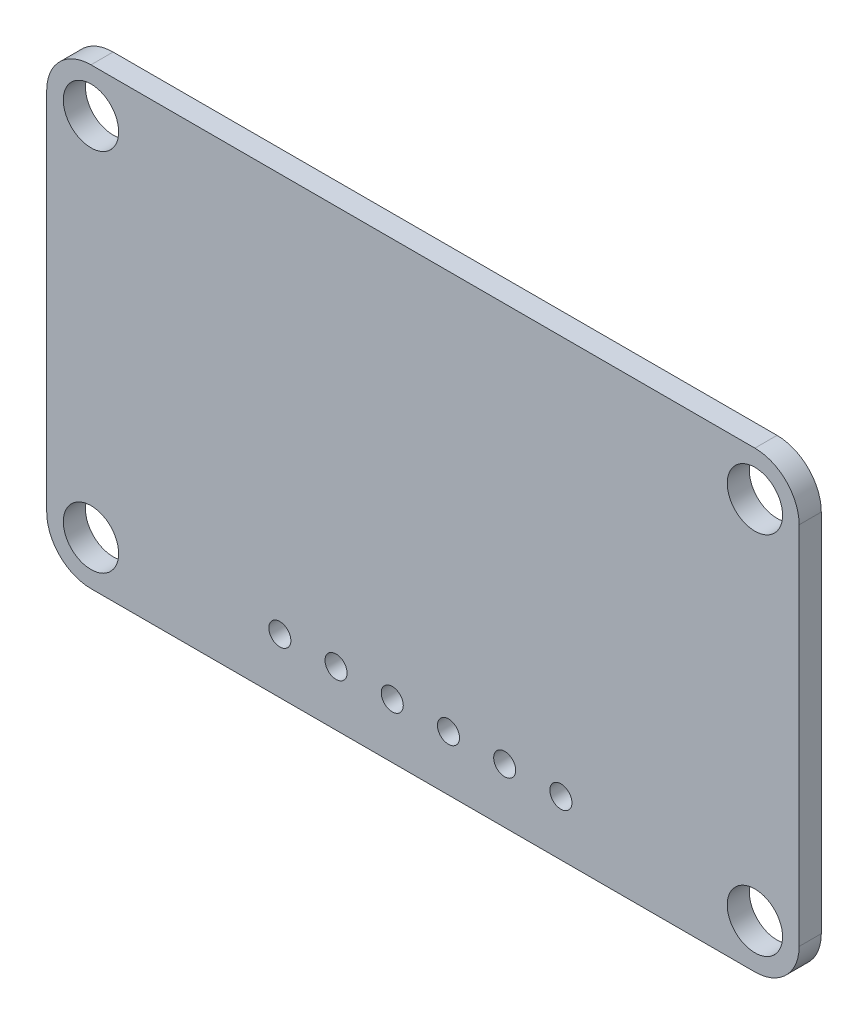
ISO-10303-21;
HEADER;
FILE_DESCRIPTION(('STEP AP214'),'2;1');
FILE_NAME('part.step','',(''),(''),'','','');
FILE_SCHEMA(('AUTOMOTIVE_DESIGN { 1 0 10303 214 1 1 1 1 }'));
ENDSEC;
DATA;
#1=APPLICATION_CONTEXT('core data for automotive mechanical design processes');
#2=APPLICATION_PROTOCOL_DEFINITION('international standard','automotive_design',2000,#1);
#3=PRODUCT_CONTEXT('',#1,'mechanical');
#4=PRODUCT('Part','Part','',(#3));
#5=PRODUCT_RELATED_PRODUCT_CATEGORY('part','',(#4));
#6=PRODUCT_DEFINITION_FORMATION('','',#4);
#7=PRODUCT_DEFINITION_CONTEXT('part definition',#1,'design');
#8=PRODUCT_DEFINITION('design','',#6,#7);
#9=PRODUCT_DEFINITION_SHAPE('','',#8);
#10=(LENGTH_UNIT() NAMED_UNIT(*) SI_UNIT(.MILLI.,.METRE.));
#11=(NAMED_UNIT(*) PLANE_ANGLE_UNIT() SI_UNIT($,.RADIAN.));
#12=(NAMED_UNIT(*) SI_UNIT($,.STERADIAN.) SOLID_ANGLE_UNIT());
#13=UNCERTAINTY_MEASURE_WITH_UNIT(LENGTH_MEASURE(1.E-05),#10,'distance_accuracy_value','');
#14=(GEOMETRIC_REPRESENTATION_CONTEXT(3) GLOBAL_UNCERTAINTY_ASSIGNED_CONTEXT((#13)) GLOBAL_UNIT_ASSIGNED_CONTEXT((#10,
#11,#12)) REPRESENTATION_CONTEXT('',''));
#15=CARTESIAN_POINT('',(0.,0.,0.));
#16=DIRECTION('',(0.,0.,1.));
#17=DIRECTION('',(1.,0.,0.));
#18=AXIS2_PLACEMENT_3D('',#15,#16,#17);
#19=CARTESIAN_POINT('',(-15.24,-10.16,1.));
#20=DIRECTION('',(1.,0.,0.));
#21=DIRECTION('',(0.,0.,-1.));
#22=AXIS2_PLACEMENT_3D('',#19,#20,#21);
#23=PLANE('',#22);
#24=DIRECTION('',(0.,-1.,0.));
#25=VECTOR('',#24,1.);
#26=CARTESIAN_POINT('',(-15.24,-10.16,1.));
#27=LINE('',#26,#25);
#28=CARTESIAN_POINT('',(-15.24,8.34,1.));
#29=VERTEX_POINT('',#28);
#30=CARTESIAN_POINT('',(-15.24,-8.16,1.));
#31=VERTEX_POINT('',#30);
#32=EDGE_CURVE('E131',#29,#31,#27,.T.);
#33=ORIENTED_EDGE('',*,*,#32,.F.);
#34=DIRECTION('',(0.,0.,-1.));
#35=VECTOR('',#34,1.);
#36=CARTESIAN_POINT('',(-15.24,8.34,1.));
#37=LINE('',#36,#35);
#38=CARTESIAN_POINT('',(-15.24,8.34,0.));
#39=VERTEX_POINT('',#38);
#40=EDGE_CURVE('E11',#29,#39,#37,.T.);
#41=ORIENTED_EDGE('',*,*,#40,.T.);
#42=DIRECTION('',(0.,-1.,0.));
#43=VECTOR('',#42,1.);
#44=CARTESIAN_POINT('',(-15.24,-10.16,0.));
#45=LINE('',#44,#43);
#46=CARTESIAN_POINT('',(-15.24,-8.16,0.));
#47=VERTEX_POINT('',#46);
#48=EDGE_CURVE('E162',#39,#47,#45,.T.);
#49=ORIENTED_EDGE('',*,*,#48,.T.);
#50=DIRECTION('',(0.,0.,-1.));
#51=VECTOR('',#50,1.);
#52=CARTESIAN_POINT('',(-15.24,-8.16,1.));
#53=LINE('',#52,#51);
#54=EDGE_CURVE('E45',#47,#31,#53,.F.);
#55=ORIENTED_EDGE('',*,*,#54,.T.);
#56=EDGE_LOOP('',(#33,#41,#49,#55));
#57=FACE_BOUND('',#56,.T.);
#58=ADVANCED_FACE('F37',(#57),#23,.F.);
#59=CARTESIAN_POINT('',(18.76,-10.16,1.));
#60=DIRECTION('',(0.,1.,0.));
#61=DIRECTION('',(0.,0.,1.));
#62=AXIS2_PLACEMENT_3D('',#59,#60,#61);
#63=PLANE('',#62);
#64=DIRECTION('',(1.,0.,0.));
#65=VECTOR('',#64,1.);
#66=CARTESIAN_POINT('',(18.76,-10.16,0.));
#67=LINE('',#66,#65);
#68=CARTESIAN_POINT('',(-13.24,-10.16,0.));
#69=VERTEX_POINT('',#68);
#70=CARTESIAN_POINT('',(16.76,-10.16,0.));
#71=VERTEX_POINT('',#70);
#72=EDGE_CURVE('E136',#69,#71,#67,.T.);
#73=ORIENTED_EDGE('',*,*,#72,.T.);
#74=DIRECTION('',(0.,0.,-1.));
#75=VECTOR('',#74,1.);
#76=CARTESIAN_POINT('',(16.76,-10.16,1.));
#77=LINE('',#76,#75);
#78=CARTESIAN_POINT('',(16.76,-10.16,1.));
#79=VERTEX_POINT('',#78);
#80=EDGE_CURVE('E52',#71,#79,#77,.F.);
#81=ORIENTED_EDGE('',*,*,#80,.T.);
#82=DIRECTION('',(1.,0.,0.));
#83=VECTOR('',#82,1.);
#84=CARTESIAN_POINT('',(18.76,-10.16,1.));
#85=LINE('',#84,#83);
#86=CARTESIAN_POINT('',(-13.24,-10.16,1.));
#87=VERTEX_POINT('',#86);
#88=EDGE_CURVE('E134',#87,#79,#85,.T.);
#89=ORIENTED_EDGE('',*,*,#88,.F.);
#90=DIRECTION('',(0.,0.,-1.));
#91=VECTOR('',#90,1.);
#92=CARTESIAN_POINT('',(-13.24,-10.16,1.));
#93=LINE('',#92,#91);
#94=EDGE_CURVE('E154',#87,#69,#93,.T.);
#95=ORIENTED_EDGE('',*,*,#94,.T.);
#96=EDGE_LOOP('',(#73,#81,#89,#95));
#97=FACE_BOUND('',#96,.T.);
#98=ADVANCED_FACE('F169',(#97),#63,.F.);
#99=CARTESIAN_POINT('',(18.76,10.34,1.));
#100=DIRECTION('',(-1.,0.,0.));
#101=DIRECTION('',(0.,0.,1.));
#102=AXIS2_PLACEMENT_3D('',#99,#100,#101);
#103=PLANE('',#102);
#104=DIRECTION('',(0.,1.,0.));
#105=VECTOR('',#104,1.);
#106=CARTESIAN_POINT('',(18.76,10.34,0.));
#107=LINE('',#106,#105);
#108=CARTESIAN_POINT('',(18.76,-8.16,0.));
#109=VERTEX_POINT('',#108);
#110=CARTESIAN_POINT('',(18.76,8.34,0.));
#111=VERTEX_POINT('',#110);
#112=EDGE_CURVE('E132',#109,#111,#107,.T.);
#113=ORIENTED_EDGE('',*,*,#112,.T.);
#114=DIRECTION('',(0.,0.,-1.));
#115=VECTOR('',#114,1.);
#116=CARTESIAN_POINT('',(18.76,8.34,1.));
#117=LINE('',#116,#115);
#118=CARTESIAN_POINT('',(18.76,8.34,1.));
#119=VERTEX_POINT('',#118);
#120=EDGE_CURVE('E109',#111,#119,#117,.F.);
#121=ORIENTED_EDGE('',*,*,#120,.T.);
#122=DIRECTION('',(0.,1.,0.));
#123=VECTOR('',#122,1.);
#124=CARTESIAN_POINT('',(18.76,10.34,1.));
#125=LINE('',#124,#123);
#126=CARTESIAN_POINT('',(18.76,-8.16,1.));
#127=VERTEX_POINT('',#126);
#128=EDGE_CURVE('E174',#127,#119,#125,.T.);
#129=ORIENTED_EDGE('',*,*,#128,.F.);
#130=DIRECTION('',(0.,0.,-1.));
#131=VECTOR('',#130,1.);
#132=CARTESIAN_POINT('',(18.76,-8.16,1.));
#133=LINE('',#132,#131);
#134=EDGE_CURVE('E114',#127,#109,#133,.T.);
#135=ORIENTED_EDGE('',*,*,#134,.T.);
#136=EDGE_LOOP('',(#113,#121,#129,#135));
#137=FACE_BOUND('',#136,.T.);
#138=ADVANCED_FACE('F287',(#137),#103,.F.);
#139=CARTESIAN_POINT('',(-15.24,10.34,1.));
#140=DIRECTION('',(0.,-1.,0.));
#141=DIRECTION('',(0.,0.,-1.));
#142=AXIS2_PLACEMENT_3D('',#139,#140,#141);
#143=PLANE('',#142);
#144=DIRECTION('',(-1.,0.,0.));
#145=VECTOR('',#144,1.);
#146=CARTESIAN_POINT('',(-15.24,10.34,1.));
#147=LINE('',#146,#145);
#148=CARTESIAN_POINT('',(16.76,10.34,1.));
#149=VERTEX_POINT('',#148);
#150=CARTESIAN_POINT('',(-13.24,10.34,1.));
#151=VERTEX_POINT('',#150);
#152=EDGE_CURVE('E124',#149,#151,#147,.T.);
#153=ORIENTED_EDGE('',*,*,#152,.F.);
#154=DIRECTION('',(0.,0.,-1.));
#155=VECTOR('',#154,1.);
#156=CARTESIAN_POINT('',(16.76,10.34,1.));
#157=LINE('',#156,#155);
#158=CARTESIAN_POINT('',(16.76,10.34,0.));
#159=VERTEX_POINT('',#158);
#160=EDGE_CURVE('E108',#149,#159,#157,.T.);
#161=ORIENTED_EDGE('',*,*,#160,.T.);
#162=DIRECTION('',(-1.,0.,0.));
#163=VECTOR('',#162,1.);
#164=CARTESIAN_POINT('',(-15.24,10.34,0.));
#165=LINE('',#164,#163);
#166=CARTESIAN_POINT('',(-13.24,10.34,0.));
#167=VERTEX_POINT('',#166);
#168=EDGE_CURVE('E121',#159,#167,#165,.T.);
#169=ORIENTED_EDGE('',*,*,#168,.T.);
#170=DIRECTION('',(0.,0.,-1.));
#171=VECTOR('',#170,1.);
#172=CARTESIAN_POINT('',(-13.24,10.34,1.));
#173=LINE('',#172,#171);
#174=EDGE_CURVE('E126',#167,#151,#173,.F.);
#175=ORIENTED_EDGE('',*,*,#174,.T.);
#176=EDGE_LOOP('',(#153,#161,#169,#175));
#177=FACE_BOUND('',#176,.T.);
#178=ADVANCED_FACE('F120',(#177),#143,.F.);
#179=CARTESIAN_POINT('',(0.,0.,1.));
#180=DIRECTION('',(0.,0.,-1.));
#181=DIRECTION('',(-1.,0.,0.));
#182=AXIS2_PLACEMENT_3D('',#179,#180,#181);
#183=PLANE('',#182);
#184=CARTESIAN_POINT('',(-13.24,-8.16,1.));
#185=DIRECTION('',(0.,0.,1.));
#186=DIRECTION('',(1.,0.,0.));
#187=AXIS2_PLACEMENT_3D('',#184,#185,#186);
#188=CIRCLE('',#187,1.25);
#189=CARTESIAN_POINT('',(-11.99,-8.16,1.));
#190=VERTEX_POINT('',#189);
#191=EDGE_CURVE('E219',#190,#190,#188,.T.);
#192=ORIENTED_EDGE('',*,*,#191,.F.);
#193=EDGE_LOOP('',(#192));
#194=FACE_BOUND('',#193,.T.);
#195=CARTESIAN_POINT('',(16.76,-8.16,1.));
#196=DIRECTION('',(0.,0.,1.));
#197=DIRECTION('',(1.,0.,0.));
#198=AXIS2_PLACEMENT_3D('',#195,#196,#197);
#199=CIRCLE('',#198,1.25);
#200=CARTESIAN_POINT('',(18.01,-8.16,1.));
#201=VERTEX_POINT('',#200);
#202=EDGE_CURVE('E225',#201,#201,#199,.T.);
#203=ORIENTED_EDGE('',*,*,#202,.F.);
#204=EDGE_LOOP('',(#203));
#205=FACE_BOUND('',#204,.T.);
#206=CARTESIAN_POINT('',(16.76,8.34,1.));
#207=DIRECTION('',(0.,0.,1.));
#208=DIRECTION('',(1.,0.,0.));
#209=AXIS2_PLACEMENT_3D('',#206,#207,#208);
#210=CIRCLE('',#209,1.25);
#211=CARTESIAN_POINT('',(18.01,8.34,1.));
#212=VERTEX_POINT('',#211);
#213=EDGE_CURVE('E231',#212,#212,#210,.T.);
#214=ORIENTED_EDGE('',*,*,#213,.F.);
#215=EDGE_LOOP('',(#214));
#216=FACE_BOUND('',#215,.T.);
#217=CARTESIAN_POINT('',(-13.24,8.34,1.));
#218=DIRECTION('',(0.,0.,1.));
#219=DIRECTION('',(1.,0.,0.));
#220=AXIS2_PLACEMENT_3D('',#217,#218,#219);
#221=CIRCLE('',#220,1.25);
#222=CARTESIAN_POINT('',(-11.99,8.34,1.));
#223=VERTEX_POINT('',#222);
#224=EDGE_CURVE('E213',#223,#223,#221,.T.);
#225=ORIENTED_EDGE('',*,*,#224,.F.);
#226=EDGE_LOOP('',(#225));
#227=FACE_BOUND('',#226,.T.);
#228=CARTESIAN_POINT('',(-2.16612049504141,-7.67557195550747,1.));
#229=DIRECTION('',(0.,0.,1.));
#230=DIRECTION('',(1.,0.,0.));
#231=AXIS2_PLACEMENT_3D('',#228,#229,#230);
#232=CIRCLE('',#231,0.498272187880337);
#233=CARTESIAN_POINT('',(-1.66784830716107,-7.67557195550747,1.));
#234=VERTEX_POINT('',#233);
#235=EDGE_CURVE('E180',#234,#234,#232,.T.);
#236=ORIENTED_EDGE('',*,*,#235,.F.);
#237=EDGE_LOOP('',(#236));
#238=FACE_BOUND('',#237,.T.);
#239=CARTESIAN_POINT('',(0.373879504958589,-7.67557195550747,1.));
#240=DIRECTION('',(0.,0.,1.));
#241=DIRECTION('',(1.,0.,0.));
#242=AXIS2_PLACEMENT_3D('',#239,#240,#241);
#243=CIRCLE('',#242,0.498272187880337);
#244=CARTESIAN_POINT('',(0.872151692838926,-7.67557195550747,1.));
#245=VERTEX_POINT('',#244);
#246=EDGE_CURVE('E205',#245,#245,#243,.T.);
#247=ORIENTED_EDGE('',*,*,#246,.F.);
#248=EDGE_LOOP('',(#247));
#249=FACE_BOUND('',#248,.T.);
#250=CARTESIAN_POINT('',(2.91387950495859,-7.67557195550747,1.));
#251=DIRECTION('',(0.,0.,1.));
#252=DIRECTION('',(1.,0.,0.));
#253=AXIS2_PLACEMENT_3D('',#250,#251,#252);
#254=CIRCLE('',#253,0.498272187880337);
#255=CARTESIAN_POINT('',(3.41215169283893,-7.67557195550747,1.));
#256=VERTEX_POINT('',#255);
#257=EDGE_CURVE('E199',#256,#256,#254,.T.);
#258=ORIENTED_EDGE('',*,*,#257,.F.);
#259=EDGE_LOOP('',(#258));
#260=FACE_BOUND('',#259,.T.);
#261=CARTESIAN_POINT('',(5.45387950495859,-7.67557195550747,1.));
#262=DIRECTION('',(0.,0.,1.));
#263=DIRECTION('',(1.,0.,0.));
#264=AXIS2_PLACEMENT_3D('',#261,#262,#263);
#265=CIRCLE('',#264,0.498272187880337);
#266=CARTESIAN_POINT('',(5.95215169283893,-7.67557195550747,1.));
#267=VERTEX_POINT('',#266);
#268=EDGE_CURVE('E193',#267,#267,#265,.T.);
#269=ORIENTED_EDGE('',*,*,#268,.F.);
#270=EDGE_LOOP('',(#269));
#271=FACE_BOUND('',#270,.T.);
#272=CARTESIAN_POINT('',(7.99387950495859,-7.67557195550747,1.));
#273=DIRECTION('',(0.,0.,1.));
#274=DIRECTION('',(1.,0.,0.));
#275=AXIS2_PLACEMENT_3D('',#272,#273,#274);
#276=CIRCLE('',#275,0.498272187880337);
#277=CARTESIAN_POINT('',(8.49215169283893,-7.67557195550747,1.));
#278=VERTEX_POINT('',#277);
#279=EDGE_CURVE('E186',#278,#278,#276,.T.);
#280=ORIENTED_EDGE('',*,*,#279,.F.);
#281=EDGE_LOOP('',(#280));
#282=FACE_BOUND('',#281,.T.);
#283=CARTESIAN_POINT('',(-4.70612049504141,-7.67557195550747,1.));
#284=DIRECTION('',(0.,0.,1.));
#285=DIRECTION('',(1.,0.,0.));
#286=AXIS2_PLACEMENT_3D('',#283,#284,#285);
#287=CIRCLE('',#286,0.498272187880337);
#288=CARTESIAN_POINT('',(-4.20784830716107,-7.67557195550747,1.));
#289=VERTEX_POINT('',#288);
#290=EDGE_CURVE('E170',#289,#289,#287,.T.);
#291=ORIENTED_EDGE('',*,*,#290,.F.);
#292=EDGE_LOOP('',(#291));
#293=FACE_BOUND('',#292,.T.);
#294=ORIENTED_EDGE('',*,*,#128,.T.);
#295=CARTESIAN_POINT('',(16.76,8.34,1.));
#296=DIRECTION('',(0.,0.,-1.));
#297=DIRECTION('',(-1.,0.,0.));
#298=AXIS2_PLACEMENT_3D('',#295,#296,#297);
#299=CIRCLE('',#298,2.);
#300=EDGE_CURVE('E152',#119,#149,#299,.F.);
#301=ORIENTED_EDGE('',*,*,#300,.T.);
#302=ORIENTED_EDGE('',*,*,#152,.T.);
#303=CARTESIAN_POINT('',(-13.24,8.34,1.));
#304=DIRECTION('',(0.,0.,-1.));
#305=DIRECTION('',(-1.,0.,0.));
#306=AXIS2_PLACEMENT_3D('',#303,#304,#305);
#307=CIRCLE('',#306,2.);
#308=EDGE_CURVE('E148',#151,#29,#307,.F.);
#309=ORIENTED_EDGE('',*,*,#308,.T.);
#310=ORIENTED_EDGE('',*,*,#32,.T.);
#311=CARTESIAN_POINT('',(-13.24,-8.16,1.));
#312=DIRECTION('',(0.,0.,-1.));
#313=DIRECTION('',(-1.,0.,0.));
#314=AXIS2_PLACEMENT_3D('',#311,#312,#313);
#315=CIRCLE('',#314,2.);
#316=EDGE_CURVE('E59',#31,#87,#315,.F.);
#317=ORIENTED_EDGE('',*,*,#316,.T.);
#318=ORIENTED_EDGE('',*,*,#88,.T.);
#319=CARTESIAN_POINT('',(16.76,-8.16,1.));
#320=DIRECTION('',(0.,0.,-1.));
#321=DIRECTION('',(-1.,0.,0.));
#322=AXIS2_PLACEMENT_3D('',#319,#320,#321);
#323=CIRCLE('',#322,2.);
#324=EDGE_CURVE('E150',#79,#127,#323,.F.);
#325=ORIENTED_EDGE('',*,*,#324,.T.);
#326=EDGE_LOOP('',(#294,#301,#302,#309,#310,#317,#318,#325));
#327=FACE_BOUND('',#326,.T.);
#328=ADVANCED_FACE('F165',(#194,#205,#216,#227,#238,#249,#260,#271,#282,#293,#327),#183,.F.);
#329=CARTESIAN_POINT('',(0.,0.,0.));
#330=DIRECTION('',(0.,0.,-1.));
#331=DIRECTION('',(-1.,0.,0.));
#332=AXIS2_PLACEMENT_3D('',#329,#330,#331);
#333=PLANE('',#332);
#334=CARTESIAN_POINT('',(-13.24,-8.16,0.));
#335=DIRECTION('',(0.,0.,1.));
#336=DIRECTION('',(1.,0.,0.));
#337=AXIS2_PLACEMENT_3D('',#334,#335,#336);
#338=CIRCLE('',#337,1.25);
#339=CARTESIAN_POINT('',(-11.99,-8.16,0.));
#340=VERTEX_POINT('',#339);
#341=EDGE_CURVE('E222',#340,#340,#338,.T.);
#342=ORIENTED_EDGE('',*,*,#341,.T.);
#343=EDGE_LOOP('',(#342));
#344=FACE_BOUND('',#343,.T.);
#345=CARTESIAN_POINT('',(16.76,-8.16,0.));
#346=DIRECTION('',(0.,0.,1.));
#347=DIRECTION('',(1.,0.,0.));
#348=AXIS2_PLACEMENT_3D('',#345,#346,#347);
#349=CIRCLE('',#348,1.25);
#350=CARTESIAN_POINT('',(18.01,-8.16,0.));
#351=VERTEX_POINT('',#350);
#352=EDGE_CURVE('E228',#351,#351,#349,.T.);
#353=ORIENTED_EDGE('',*,*,#352,.T.);
#354=EDGE_LOOP('',(#353));
#355=FACE_BOUND('',#354,.T.);
#356=CARTESIAN_POINT('',(16.76,8.34,0.));
#357=DIRECTION('',(0.,0.,1.));
#358=DIRECTION('',(1.,0.,0.));
#359=AXIS2_PLACEMENT_3D('',#356,#357,#358);
#360=CIRCLE('',#359,1.25);
#361=CARTESIAN_POINT('',(18.01,8.34,0.));
#362=VERTEX_POINT('',#361);
#363=EDGE_CURVE('E216',#362,#362,#360,.T.);
#364=ORIENTED_EDGE('',*,*,#363,.T.);
#365=EDGE_LOOP('',(#364));
#366=FACE_BOUND('',#365,.T.);
#367=CARTESIAN_POINT('',(-13.24,8.34,0.));
#368=DIRECTION('',(0.,0.,1.));
#369=DIRECTION('',(1.,0.,0.));
#370=AXIS2_PLACEMENT_3D('',#367,#368,#369);
#371=CIRCLE('',#370,1.25);
#372=CARTESIAN_POINT('',(-11.99,8.34,0.));
#373=VERTEX_POINT('',#372);
#374=EDGE_CURVE('E187',#373,#373,#371,.T.);
#375=ORIENTED_EDGE('',*,*,#374,.T.);
#376=EDGE_LOOP('',(#375));
#377=FACE_BOUND('',#376,.T.);
#378=CARTESIAN_POINT('',(-2.16612049504141,-7.67557195550747,0.));
#379=DIRECTION('',(0.,0.,-1.));
#380=DIRECTION('',(-1.,0.,0.));
#381=AXIS2_PLACEMENT_3D('',#378,#379,#380);
#382=CIRCLE('',#381,0.498272187880337);
#383=CARTESIAN_POINT('',(-2.66439268292175,-7.67557195550747,0.));
#384=VERTEX_POINT('',#383);
#385=EDGE_CURVE('E208',#384,#384,#382,.F.);
#386=ORIENTED_EDGE('',*,*,#385,.T.);
#387=EDGE_LOOP('',(#386));
#388=FACE_BOUND('',#387,.T.);
#389=CARTESIAN_POINT('',(0.373879504958589,-7.67557195550747,0.));
#390=DIRECTION('',(0.,0.,-1.));
#391=DIRECTION('',(-1.,0.,0.));
#392=AXIS2_PLACEMENT_3D('',#389,#390,#391);
#393=CIRCLE('',#392,0.498272187880337);
#394=CARTESIAN_POINT('',(-0.124392682921749,-7.67557195550747,0.));
#395=VERTEX_POINT('',#394);
#396=EDGE_CURVE('E202',#395,#395,#393,.F.);
#397=ORIENTED_EDGE('',*,*,#396,.T.);
#398=EDGE_LOOP('',(#397));
#399=FACE_BOUND('',#398,.T.);
#400=CARTESIAN_POINT('',(2.91387950495859,-7.67557195550747,0.));
#401=DIRECTION('',(0.,0.,-1.));
#402=DIRECTION('',(-1.,0.,0.));
#403=AXIS2_PLACEMENT_3D('',#400,#401,#402);
#404=CIRCLE('',#403,0.498272187880337);
#405=CARTESIAN_POINT('',(2.41560731707825,-7.67557195550747,0.));
#406=VERTEX_POINT('',#405);
#407=EDGE_CURVE('E196',#406,#406,#404,.F.);
#408=ORIENTED_EDGE('',*,*,#407,.T.);
#409=EDGE_LOOP('',(#408));
#410=FACE_BOUND('',#409,.T.);
#411=CARTESIAN_POINT('',(5.45387950495859,-7.67557195550747,0.));
#412=DIRECTION('',(0.,0.,-1.));
#413=DIRECTION('',(-1.,0.,0.));
#414=AXIS2_PLACEMENT_3D('',#411,#412,#413);
#415=CIRCLE('',#414,0.498272187880337);
#416=CARTESIAN_POINT('',(4.95560731707825,-7.67557195550747,0.));
#417=VERTEX_POINT('',#416);
#418=EDGE_CURVE('E190',#417,#417,#415,.F.);
#419=ORIENTED_EDGE('',*,*,#418,.T.);
#420=EDGE_LOOP('',(#419));
#421=FACE_BOUND('',#420,.T.);
#422=CARTESIAN_POINT('',(7.99387950495859,-7.67557195550747,0.));
#423=DIRECTION('',(0.,0.,-1.));
#424=DIRECTION('',(-1.,0.,0.));
#425=AXIS2_PLACEMENT_3D('',#422,#423,#424);
#426=CIRCLE('',#425,0.498272187880337);
#427=CARTESIAN_POINT('',(7.49560731707825,-7.67557195550747,0.));
#428=VERTEX_POINT('',#427);
#429=EDGE_CURVE('E183',#428,#428,#426,.F.);
#430=ORIENTED_EDGE('',*,*,#429,.T.);
#431=EDGE_LOOP('',(#430));
#432=FACE_BOUND('',#431,.T.);
#433=CARTESIAN_POINT('',(-4.70612049504141,-7.67557195550747,0.));
#434=DIRECTION('',(0.,0.,-1.));
#435=DIRECTION('',(-1.,0.,0.));
#436=AXIS2_PLACEMENT_3D('',#433,#434,#435);
#437=CIRCLE('',#436,0.498272187880337);
#438=CARTESIAN_POINT('',(-5.20439268292175,-7.67557195550747,0.));
#439=VERTEX_POINT('',#438);
#440=EDGE_CURVE('E177',#439,#439,#437,.F.);
#441=ORIENTED_EDGE('',*,*,#440,.T.);
#442=EDGE_LOOP('',(#441));
#443=FACE_BOUND('',#442,.T.);
#444=ORIENTED_EDGE('',*,*,#168,.F.);
#445=CARTESIAN_POINT('',(16.76,8.34,0.));
#446=DIRECTION('',(0.,0.,-1.));
#447=DIRECTION('',(-1.,0.,0.));
#448=AXIS2_PLACEMENT_3D('',#445,#446,#447);
#449=CIRCLE('',#448,2.);
#450=EDGE_CURVE('E104',#159,#111,#449,.T.);
#451=ORIENTED_EDGE('',*,*,#450,.T.);
#452=ORIENTED_EDGE('',*,*,#112,.F.);
#453=CARTESIAN_POINT('',(16.76,-8.16,0.));
#454=DIRECTION('',(0.,0.,-1.));
#455=DIRECTION('',(-1.,0.,0.));
#456=AXIS2_PLACEMENT_3D('',#453,#454,#455);
#457=CIRCLE('',#456,2.);
#458=EDGE_CURVE('E115',#109,#71,#457,.T.);
#459=ORIENTED_EDGE('',*,*,#458,.T.);
#460=ORIENTED_EDGE('',*,*,#72,.F.);
#461=CARTESIAN_POINT('',(-13.24,-8.16,0.));
#462=DIRECTION('',(0.,0.,-1.));
#463=DIRECTION('',(-1.,0.,0.));
#464=AXIS2_PLACEMENT_3D('',#461,#462,#463);
#465=CIRCLE('',#464,2.);
#466=EDGE_CURVE('E125',#69,#47,#465,.T.);
#467=ORIENTED_EDGE('',*,*,#466,.T.);
#468=ORIENTED_EDGE('',*,*,#48,.F.);
#469=CARTESIAN_POINT('',(-13.24,8.34,0.));
#470=DIRECTION('',(0.,0.,-1.));
#471=DIRECTION('',(-1.,0.,0.));
#472=AXIS2_PLACEMENT_3D('',#469,#470,#471);
#473=CIRCLE('',#472,2.);
#474=EDGE_CURVE('E130',#39,#167,#473,.T.);
#475=ORIENTED_EDGE('',*,*,#474,.T.);
#476=EDGE_LOOP('',(#444,#451,#452,#459,#460,#467,#468,#475));
#477=FACE_BOUND('',#476,.T.);
#478=ADVANCED_FACE('F128',(#344,#355,#366,#377,#388,#399,#410,#421,#432,#443,#477),#333,.T.);
#479=CARTESIAN_POINT('',(-4.70612049504141,-7.67557195550747,-0.000999999999999916));
#480=DIRECTION('',(0.,0.,1.));
#481=DIRECTION('',(1.,0.,0.));
#482=AXIS2_PLACEMENT_3D('',#479,#480,#481);
#483=CYLINDRICAL_SURFACE('',#482,0.498272187880337);
#484=ORIENTED_EDGE('',*,*,#440,.F.);
#485=EDGE_LOOP('',(#484));
#486=FACE_BOUND('',#485,.T.);
#487=ORIENTED_EDGE('',*,*,#290,.T.);
#488=EDGE_LOOP('',(#487));
#489=FACE_BOUND('',#488,.T.);
#490=ADVANCED_FACE('F265',(#486,#489),#483,.F.);
#491=CARTESIAN_POINT('',(7.99387950495859,-7.67557195550747,-0.000999999999999916));
#492=DIRECTION('',(0.,0.,1.));
#493=DIRECTION('',(1.,0.,0.));
#494=AXIS2_PLACEMENT_3D('',#491,#492,#493);
#495=CYLINDRICAL_SURFACE('',#494,0.498272187880337);
#496=ORIENTED_EDGE('',*,*,#429,.F.);
#497=EDGE_LOOP('',(#496));
#498=FACE_BOUND('',#497,.T.);
#499=ORIENTED_EDGE('',*,*,#279,.T.);
#500=EDGE_LOOP('',(#499));
#501=FACE_BOUND('',#500,.T.);
#502=ADVANCED_FACE('F267',(#498,#501),#495,.F.);
#503=CARTESIAN_POINT('',(5.45387950495859,-7.67557195550747,-0.000999999999999916));
#504=DIRECTION('',(0.,0.,1.));
#505=DIRECTION('',(1.,0.,0.));
#506=AXIS2_PLACEMENT_3D('',#503,#504,#505);
#507=CYLINDRICAL_SURFACE('',#506,0.498272187880337);
#508=ORIENTED_EDGE('',*,*,#418,.F.);
#509=EDGE_LOOP('',(#508));
#510=FACE_BOUND('',#509,.T.);
#511=ORIENTED_EDGE('',*,*,#268,.T.);
#512=EDGE_LOOP('',(#511));
#513=FACE_BOUND('',#512,.T.);
#514=ADVANCED_FACE('F274',(#510,#513),#507,.F.);
#515=CARTESIAN_POINT('',(2.91387950495859,-7.67557195550747,-0.000999999999999916));
#516=DIRECTION('',(0.,0.,1.));
#517=DIRECTION('',(1.,0.,0.));
#518=AXIS2_PLACEMENT_3D('',#515,#516,#517);
#519=CYLINDRICAL_SURFACE('',#518,0.498272187880337);
#520=ORIENTED_EDGE('',*,*,#407,.F.);
#521=EDGE_LOOP('',(#520));
#522=FACE_BOUND('',#521,.T.);
#523=ORIENTED_EDGE('',*,*,#257,.T.);
#524=EDGE_LOOP('',(#523));
#525=FACE_BOUND('',#524,.T.);
#526=ADVANCED_FACE('F384',(#522,#525),#519,.F.);
#527=CARTESIAN_POINT('',(0.373879504958589,-7.67557195550747,-0.000999999999999916));
#528=DIRECTION('',(0.,0.,1.));
#529=DIRECTION('',(1.,0.,0.));
#530=AXIS2_PLACEMENT_3D('',#527,#528,#529);
#531=CYLINDRICAL_SURFACE('',#530,0.498272187880337);
#532=ORIENTED_EDGE('',*,*,#396,.F.);
#533=EDGE_LOOP('',(#532));
#534=FACE_BOUND('',#533,.T.);
#535=ORIENTED_EDGE('',*,*,#246,.T.);
#536=EDGE_LOOP('',(#535));
#537=FACE_BOUND('',#536,.T.);
#538=ADVANCED_FACE('F376',(#534,#537),#531,.F.);
#539=CARTESIAN_POINT('',(-2.16612049504141,-7.67557195550747,-0.000999999999999916));
#540=DIRECTION('',(0.,0.,1.));
#541=DIRECTION('',(1.,0.,0.));
#542=AXIS2_PLACEMENT_3D('',#539,#540,#541);
#543=CYLINDRICAL_SURFACE('',#542,0.498272187880337);
#544=ORIENTED_EDGE('',*,*,#385,.F.);
#545=EDGE_LOOP('',(#544));
#546=FACE_BOUND('',#545,.T.);
#547=ORIENTED_EDGE('',*,*,#235,.T.);
#548=EDGE_LOOP('',(#547));
#549=FACE_BOUND('',#548,.T.);
#550=ADVANCED_FACE('F368',(#546,#549),#543,.F.);
#551=CARTESIAN_POINT('',(-13.24,8.34,0.));
#552=DIRECTION('',(0.,0.,1.));
#553=DIRECTION('',(1.,0.,0.));
#554=AXIS2_PLACEMENT_3D('',#551,#552,#553);
#555=CYLINDRICAL_SURFACE('',#554,1.25);
#556=ORIENTED_EDGE('',*,*,#374,.F.);
#557=EDGE_LOOP('',(#556));
#558=FACE_BOUND('',#557,.T.);
#559=ORIENTED_EDGE('',*,*,#224,.T.);
#560=EDGE_LOOP('',(#559));
#561=FACE_BOUND('',#560,.T.);
#562=ADVANCED_FACE('F243',(#558,#561),#555,.F.);
#563=CARTESIAN_POINT('',(16.76,8.34,0.));
#564=DIRECTION('',(0.,0.,1.));
#565=DIRECTION('',(1.,0.,0.));
#566=AXIS2_PLACEMENT_3D('',#563,#564,#565);
#567=CYLINDRICAL_SURFACE('',#566,1.25);
#568=ORIENTED_EDGE('',*,*,#363,.F.);
#569=EDGE_LOOP('',(#568));
#570=FACE_BOUND('',#569,.T.);
#571=ORIENTED_EDGE('',*,*,#213,.T.);
#572=EDGE_LOOP('',(#571));
#573=FACE_BOUND('',#572,.T.);
#574=ADVANCED_FACE('F239',(#570,#573),#567,.F.);
#575=CARTESIAN_POINT('',(16.76,-8.16,0.));
#576=DIRECTION('',(0.,0.,1.));
#577=DIRECTION('',(1.,0.,0.));
#578=AXIS2_PLACEMENT_3D('',#575,#576,#577);
#579=CYLINDRICAL_SURFACE('',#578,1.25);
#580=ORIENTED_EDGE('',*,*,#352,.F.);
#581=EDGE_LOOP('',(#580));
#582=FACE_BOUND('',#581,.T.);
#583=ORIENTED_EDGE('',*,*,#202,.T.);
#584=EDGE_LOOP('',(#583));
#585=FACE_BOUND('',#584,.T.);
#586=ADVANCED_FACE('F242',(#582,#585),#579,.F.);
#587=CARTESIAN_POINT('',(-13.24,-8.16,0.));
#588=DIRECTION('',(0.,0.,1.));
#589=DIRECTION('',(1.,0.,0.));
#590=AXIS2_PLACEMENT_3D('',#587,#588,#589);
#591=CYLINDRICAL_SURFACE('',#590,1.25);
#592=ORIENTED_EDGE('',*,*,#341,.F.);
#593=EDGE_LOOP('',(#592));
#594=FACE_BOUND('',#593,.T.);
#595=ORIENTED_EDGE('',*,*,#191,.T.);
#596=EDGE_LOOP('',(#595));
#597=FACE_BOUND('',#596,.T.);
#598=ADVANCED_FACE('F294',(#594,#597),#591,.F.);
#599=CARTESIAN_POINT('',(16.76,8.34,1.));
#600=DIRECTION('',(0.,0.,-1.));
#601=DIRECTION('',(-1.,0.,0.));
#602=AXIS2_PLACEMENT_3D('',#599,#600,#601);
#603=CYLINDRICAL_SURFACE('',#602,2.);
#604=ORIENTED_EDGE('',*,*,#300,.F.);
#605=ORIENTED_EDGE('',*,*,#120,.F.);
#606=ORIENTED_EDGE('',*,*,#450,.F.);
#607=ORIENTED_EDGE('',*,*,#160,.F.);
#608=EDGE_LOOP('',(#604,#605,#606,#607));
#609=FACE_BOUND('',#608,.T.);
#610=ADVANCED_FACE('F107',(#609),#603,.T.);
#611=CARTESIAN_POINT('',(16.76,-8.16,1.));
#612=DIRECTION('',(0.,0.,-1.));
#613=DIRECTION('',(-1.,0.,0.));
#614=AXIS2_PLACEMENT_3D('',#611,#612,#613);
#615=CYLINDRICAL_SURFACE('',#614,2.);
#616=ORIENTED_EDGE('',*,*,#324,.F.);
#617=ORIENTED_EDGE('',*,*,#80,.F.);
#618=ORIENTED_EDGE('',*,*,#458,.F.);
#619=ORIENTED_EDGE('',*,*,#134,.F.);
#620=EDGE_LOOP('',(#616,#617,#618,#619));
#621=FACE_BOUND('',#620,.T.);
#622=ADVANCED_FACE('F293',(#621),#615,.T.);
#623=CARTESIAN_POINT('',(-13.24,8.34,1.));
#624=DIRECTION('',(0.,0.,-1.));
#625=DIRECTION('',(-1.,0.,0.));
#626=AXIS2_PLACEMENT_3D('',#623,#624,#625);
#627=CYLINDRICAL_SURFACE('',#626,2.);
#628=ORIENTED_EDGE('',*,*,#308,.F.);
#629=ORIENTED_EDGE('',*,*,#174,.F.);
#630=ORIENTED_EDGE('',*,*,#474,.F.);
#631=ORIENTED_EDGE('',*,*,#40,.F.);
#632=EDGE_LOOP('',(#628,#629,#630,#631));
#633=FACE_BOUND('',#632,.T.);
#634=ADVANCED_FACE('F296',(#633),#627,.T.);
#635=CARTESIAN_POINT('',(-13.24,-8.16,1.));
#636=DIRECTION('',(0.,0.,-1.));
#637=DIRECTION('',(-1.,0.,0.));
#638=AXIS2_PLACEMENT_3D('',#635,#636,#637);
#639=CYLINDRICAL_SURFACE('',#638,2.);
#640=ORIENTED_EDGE('',*,*,#316,.F.);
#641=ORIENTED_EDGE('',*,*,#54,.F.);
#642=ORIENTED_EDGE('',*,*,#466,.F.);
#643=ORIENTED_EDGE('',*,*,#94,.F.);
#644=EDGE_LOOP('',(#640,#641,#642,#643));
#645=FACE_BOUND('',#644,.T.);
#646=ADVANCED_FACE('F39',(#645),#639,.T.);
#647=CLOSED_SHELL('',(#58,#98,#138,#178,#328,#478,#490,#502,#514,#526,#538,#550,#562,#574,#586,
#598,#610,#622,#634,#646));
#648=MANIFOLD_SOLID_BREP('B2',#647);
#649=ADVANCED_BREP_SHAPE_REPRESENTATION('',(#18,#648),#14);
#650=SHAPE_DEFINITION_REPRESENTATION(#9,#649);
ENDSEC;
END-ISO-10303-21;
